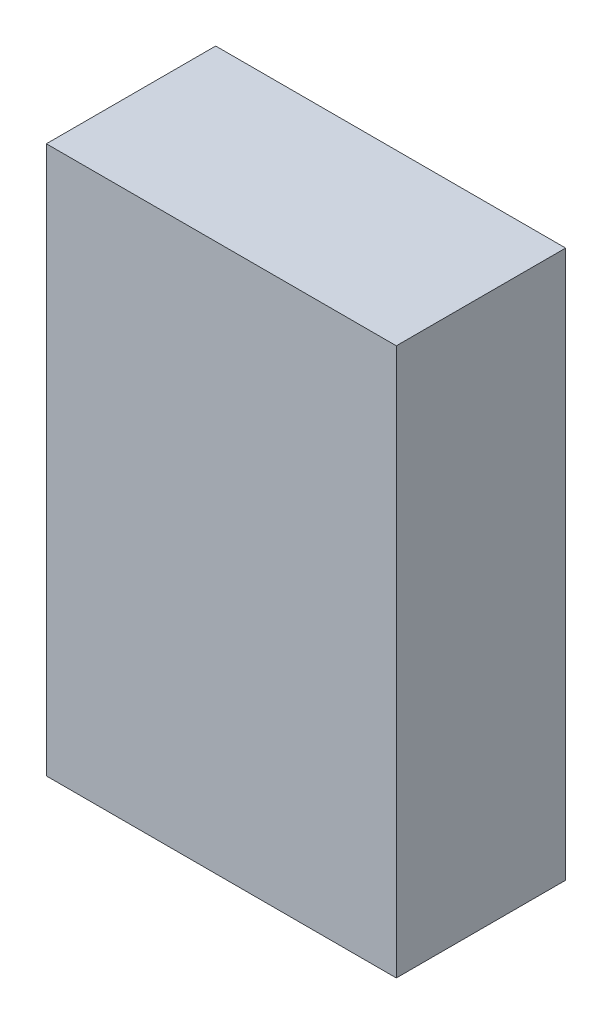
ISO-10303-21;
HEADER;
FILE_DESCRIPTION(('STEP AP214'),'2;1');
FILE_NAME('part.step','',(''),(''),'','','');
FILE_SCHEMA(('AUTOMOTIVE_DESIGN { 1 0 10303 214 1 1 1 1 }'));
ENDSEC;
DATA;
#1=APPLICATION_CONTEXT('core data for automotive mechanical design processes');
#2=APPLICATION_PROTOCOL_DEFINITION('international standard','automotive_design',2000,#1);
#3=PRODUCT_CONTEXT('',#1,'mechanical');
#4=PRODUCT('Part','Part','',(#3));
#5=PRODUCT_RELATED_PRODUCT_CATEGORY('part','',(#4));
#6=PRODUCT_DEFINITION_FORMATION('','',#4);
#7=PRODUCT_DEFINITION_CONTEXT('part definition',#1,'design');
#8=PRODUCT_DEFINITION('design','',#6,#7);
#9=PRODUCT_DEFINITION_SHAPE('','',#8);
#10=(LENGTH_UNIT() NAMED_UNIT(*) SI_UNIT(.MILLI.,.METRE.));
#11=(NAMED_UNIT(*) PLANE_ANGLE_UNIT() SI_UNIT($,.RADIAN.));
#12=(NAMED_UNIT(*) SI_UNIT($,.STERADIAN.) SOLID_ANGLE_UNIT());
#13=UNCERTAINTY_MEASURE_WITH_UNIT(LENGTH_MEASURE(1.E-05),#10,'distance_accuracy_value','');
#14=(GEOMETRIC_REPRESENTATION_CONTEXT(3) GLOBAL_UNCERTAINTY_ASSIGNED_CONTEXT((#13)) GLOBAL_UNIT_ASSIGNED_CONTEXT((#10,
#11,#12)) REPRESENTATION_CONTEXT('',''));
#15=CARTESIAN_POINT('',(0.,0.,0.));
#16=DIRECTION('',(0.,0.,1.));
#17=DIRECTION('',(1.,0.,0.));
#18=AXIS2_PLACEMENT_3D('',#15,#16,#17);
#19=CARTESIAN_POINT('',(31.,48.5,30.));
#20=DIRECTION('',(-1.,0.,0.));
#21=DIRECTION('',(0.,-1.,0.));
#22=AXIS2_PLACEMENT_3D('',#19,#20,#21);
#23=PLANE('',#22);
#24=DIRECTION('',(0.,1.,0.));
#25=VECTOR('',#24,1.);
#26=CARTESIAN_POINT('',(31.,48.5,0.));
#27=LINE('',#26,#25);
#28=CARTESIAN_POINT('',(31.,-48.5,0.));
#29=VERTEX_POINT('',#28);
#30=CARTESIAN_POINT('',(31.,48.5,0.));
#31=VERTEX_POINT('',#30);
#32=EDGE_CURVE('E96',#29,#31,#27,.T.);
#33=ORIENTED_EDGE('',*,*,#32,.T.);
#34=DIRECTION('',(0.,0.,-1.));
#35=VECTOR('',#34,1.);
#36=CARTESIAN_POINT('',(31.,48.5,30.));
#37=LINE('',#36,#35);
#38=CARTESIAN_POINT('',(31.,48.5,30.));
#39=VERTEX_POINT('',#38);
#40=EDGE_CURVE('E11',#39,#31,#37,.T.);
#41=ORIENTED_EDGE('',*,*,#40,.F.);
#42=DIRECTION('',(0.,1.,0.));
#43=VECTOR('',#42,1.);
#44=CARTESIAN_POINT('',(31.,48.5,30.));
#45=LINE('',#44,#43);
#46=CARTESIAN_POINT('',(31.,-48.5,30.));
#47=VERTEX_POINT('',#46);
#48=EDGE_CURVE('E84',#47,#39,#45,.T.);
#49=ORIENTED_EDGE('',*,*,#48,.F.);
#50=DIRECTION('',(0.,0.,-1.));
#51=VECTOR('',#50,1.);
#52=CARTESIAN_POINT('',(31.,-48.5,30.));
#53=LINE('',#52,#51);
#54=EDGE_CURVE('E92',#47,#29,#53,.T.);
#55=ORIENTED_EDGE('',*,*,#54,.T.);
#56=EDGE_LOOP('',(#33,#41,#49,#55));
#57=FACE_BOUND('',#56,.T.);
#58=ADVANCED_FACE('F33',(#57),#23,.F.);
#59=CARTESIAN_POINT('',(-31.,48.5,30.));
#60=DIRECTION('',(0.,-1.,0.));
#61=DIRECTION('',(0.,0.,-1.));
#62=AXIS2_PLACEMENT_3D('',#59,#60,#61);
#63=PLANE('',#62);
#64=DIRECTION('',(-1.,0.,0.));
#65=VECTOR('',#64,1.);
#66=CARTESIAN_POINT('',(-31.,48.5,0.));
#67=LINE('',#66,#65);
#68=CARTESIAN_POINT('',(-31.,48.5,0.));
#69=VERTEX_POINT('',#68);
#70=EDGE_CURVE('E88',#31,#69,#67,.T.);
#71=ORIENTED_EDGE('',*,*,#70,.T.);
#72=DIRECTION('',(0.,0.,-1.));
#73=VECTOR('',#72,1.);
#74=CARTESIAN_POINT('',(-31.,48.5,30.));
#75=LINE('',#74,#73);
#76=CARTESIAN_POINT('',(-31.,48.5,30.));
#77=VERTEX_POINT('',#76);
#78=EDGE_CURVE('E41',#77,#69,#75,.T.);
#79=ORIENTED_EDGE('',*,*,#78,.F.);
#80=DIRECTION('',(-1.,0.,0.));
#81=VECTOR('',#80,1.);
#82=CARTESIAN_POINT('',(-31.,48.5,30.));
#83=LINE('',#82,#81);
#84=EDGE_CURVE('E79',#39,#77,#83,.T.);
#85=ORIENTED_EDGE('',*,*,#84,.F.);
#86=ORIENTED_EDGE('',*,*,#40,.T.);
#87=EDGE_LOOP('',(#71,#79,#85,#86));
#88=FACE_BOUND('',#87,.T.);
#89=ADVANCED_FACE('F87',(#88),#63,.F.);
#90=CARTESIAN_POINT('',(-31.,48.5,30.));
#91=DIRECTION('',(1.,0.,0.));
#92=DIRECTION('',(0.,1.,0.));
#93=AXIS2_PLACEMENT_3D('',#90,#91,#92);
#94=PLANE('',#93);
#95=DIRECTION('',(0.,-1.,0.));
#96=VECTOR('',#95,1.);
#97=CARTESIAN_POINT('',(-31.,48.5,0.));
#98=LINE('',#97,#96);
#99=CARTESIAN_POINT('',(-31.,-48.5,0.));
#100=VERTEX_POINT('',#99);
#101=EDGE_CURVE('E66',#69,#100,#98,.T.);
#102=ORIENTED_EDGE('',*,*,#101,.T.);
#103=DIRECTION('',(0.,0.,-1.));
#104=VECTOR('',#103,1.);
#105=CARTESIAN_POINT('',(-31.,-48.5,30.));
#106=LINE('',#105,#104);
#107=CARTESIAN_POINT('',(-31.,-48.5,30.));
#108=VERTEX_POINT('',#107);
#109=EDGE_CURVE('E89',#108,#100,#106,.T.);
#110=ORIENTED_EDGE('',*,*,#109,.F.);
#111=DIRECTION('',(0.,-1.,0.));
#112=VECTOR('',#111,1.);
#113=CARTESIAN_POINT('',(-31.,48.5,30.));
#114=LINE('',#113,#112);
#115=EDGE_CURVE('E82',#77,#108,#114,.T.);
#116=ORIENTED_EDGE('',*,*,#115,.F.);
#117=ORIENTED_EDGE('',*,*,#78,.T.);
#118=EDGE_LOOP('',(#102,#110,#116,#117));
#119=FACE_BOUND('',#118,.T.);
#120=ADVANCED_FACE('F90',(#119),#94,.F.);
#121=CARTESIAN_POINT('',(-31.,-48.5,30.));
#122=DIRECTION('',(0.,1.,0.));
#123=DIRECTION('',(0.,0.,1.));
#124=AXIS2_PLACEMENT_3D('',#121,#122,#123);
#125=PLANE('',#124);
#126=DIRECTION('',(1.,0.,0.));
#127=VECTOR('',#126,1.);
#128=CARTESIAN_POINT('',(-31.,-48.5,0.));
#129=LINE('',#128,#127);
#130=EDGE_CURVE('E72',#100,#29,#129,.T.);
#131=ORIENTED_EDGE('',*,*,#130,.T.);
#132=ORIENTED_EDGE('',*,*,#54,.F.);
#133=DIRECTION('',(1.,0.,0.));
#134=VECTOR('',#133,1.);
#135=CARTESIAN_POINT('',(-31.,-48.5,30.));
#136=LINE('',#135,#134);
#137=EDGE_CURVE('E49',#108,#47,#136,.T.);
#138=ORIENTED_EDGE('',*,*,#137,.F.);
#139=ORIENTED_EDGE('',*,*,#109,.T.);
#140=EDGE_LOOP('',(#131,#132,#138,#139));
#141=FACE_BOUND('',#140,.T.);
#142=ADVANCED_FACE('F103',(#141),#125,.F.);
#143=CARTESIAN_POINT('',(0.,0.,30.));
#144=DIRECTION('',(0.,0.,1.));
#145=DIRECTION('',(1.,0.,0.));
#146=AXIS2_PLACEMENT_3D('',#143,#144,#145);
#147=PLANE('',#146);
#148=ORIENTED_EDGE('',*,*,#48,.T.);
#149=ORIENTED_EDGE('',*,*,#84,.T.);
#150=ORIENTED_EDGE('',*,*,#115,.T.);
#151=ORIENTED_EDGE('',*,*,#137,.T.);
#152=EDGE_LOOP('',(#148,#149,#150,#151));
#153=FACE_BOUND('',#152,.T.);
#154=ADVANCED_FACE('F80',(#153),#147,.T.);
#155=CARTESIAN_POINT('',(0.,0.,0.));
#156=DIRECTION('',(0.,0.,1.));
#157=DIRECTION('',(1.,0.,0.));
#158=AXIS2_PLACEMENT_3D('',#155,#156,#157);
#159=PLANE('',#158);
#160=ORIENTED_EDGE('',*,*,#32,.F.);
#161=ORIENTED_EDGE('',*,*,#130,.F.);
#162=ORIENTED_EDGE('',*,*,#101,.F.);
#163=ORIENTED_EDGE('',*,*,#70,.F.);
#164=EDGE_LOOP('',(#160,#161,#162,#163));
#165=FACE_BOUND('',#164,.T.);
#166=ADVANCED_FACE('F106',(#165),#159,.F.);
#167=CLOSED_SHELL('',(#58,#89,#120,#142,#154,#166));
#168=MANIFOLD_SOLID_BREP('B2',#167);
#169=ADVANCED_BREP_SHAPE_REPRESENTATION('',(#18,#168),#14);
#170=SHAPE_DEFINITION_REPRESENTATION(#9,#169);
ENDSEC;
END-ISO-10303-21;
